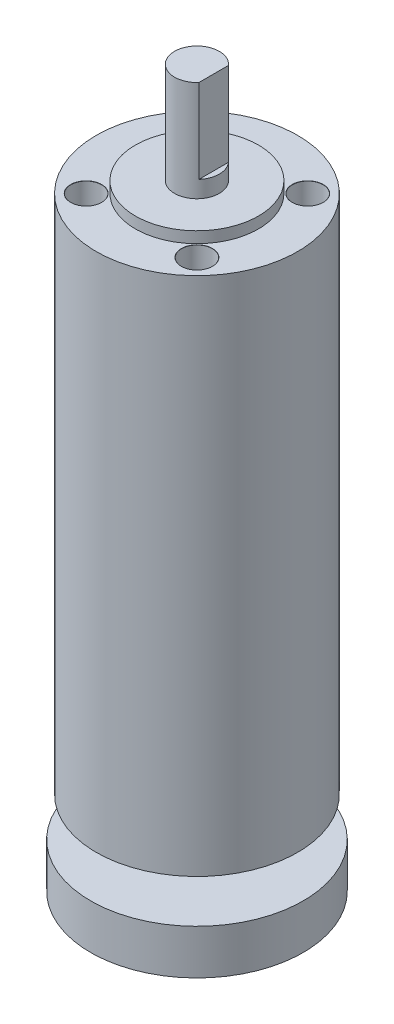
ISO-10303-21;
HEADER;
FILE_DESCRIPTION(('STEP AP214'),'2;1');
FILE_NAME('part.step','',(''),(''),'','','');
FILE_SCHEMA(('AUTOMOTIVE_DESIGN { 1 0 10303 214 1 1 1 1 }'));
ENDSEC;
DATA;
#1=APPLICATION_CONTEXT('core data for automotive mechanical design processes');
#2=APPLICATION_PROTOCOL_DEFINITION('international standard','automotive_design',2000,#1);
#3=PRODUCT_CONTEXT('',#1,'mechanical');
#4=PRODUCT('Part','Part','',(#3));
#5=PRODUCT_RELATED_PRODUCT_CATEGORY('part','',(#4));
#6=PRODUCT_DEFINITION_FORMATION('','',#4);
#7=PRODUCT_DEFINITION_CONTEXT('part definition',#1,'design');
#8=PRODUCT_DEFINITION('design','',#6,#7);
#9=PRODUCT_DEFINITION_SHAPE('','',#8);
#10=(LENGTH_UNIT() NAMED_UNIT(*) SI_UNIT(.MILLI.,.METRE.));
#11=(NAMED_UNIT(*) PLANE_ANGLE_UNIT() SI_UNIT($,.RADIAN.));
#12=(NAMED_UNIT(*) SI_UNIT($,.STERADIAN.) SOLID_ANGLE_UNIT());
#13=UNCERTAINTY_MEASURE_WITH_UNIT(LENGTH_MEASURE(1.E-05),#10,'distance_accuracy_value','');
#14=(GEOMETRIC_REPRESENTATION_CONTEXT(3) GLOBAL_UNCERTAINTY_ASSIGNED_CONTEXT((#13)) GLOBAL_UNIT_ASSIGNED_CONTEXT((#10,
#11,#12)) REPRESENTATION_CONTEXT('',''));
#15=CARTESIAN_POINT('',(0.,0.,0.));
#16=DIRECTION('',(0.,0.,1.));
#17=DIRECTION('',(1.,0.,0.));
#18=AXIS2_PLACEMENT_3D('',#15,#16,#17);
#19=CARTESIAN_POINT('',(0.,-15.,0.));
#20=DIRECTION('',(0.,1.,0.));
#21=DIRECTION('',(-1.,0.,0.));
#22=AXIS2_PLACEMENT_3D('',#19,#20,#21);
#23=PLANE('',#22);
#24=CARTESIAN_POINT('',(0.,-15.,0.));
#25=DIRECTION('',(0.,1.,0.));
#26=DIRECTION('',(-1.,0.,0.));
#27=AXIS2_PLACEMENT_3D('',#24,#25,#26);
#28=CIRCLE('',#27,19.);
#29=CARTESIAN_POINT('',(-19.,-15.,0.));
#30=VERTEX_POINT('',#29);
#31=EDGE_CURVE('E158',#30,#30,#28,.T.);
#32=ORIENTED_EDGE('',*,*,#31,.F.);
#33=EDGE_LOOP('',(#32));
#34=FACE_BOUND('',#33,.T.);
#35=ADVANCED_FACE('F45',(#34),#23,.F.);
#36=CARTESIAN_POINT('',(0.,113.,0.));
#37=DIRECTION('',(0.,1.,0.));
#38=DIRECTION('',(-1.,0.,0.));
#39=AXIS2_PLACEMENT_3D('',#36,#37,#38);
#40=CYLINDRICAL_SURFACE('',#39,19.);
#41=CARTESIAN_POINT('',(0.,-7.00000000000001,0.));
#42=DIRECTION('',(0.,1.,0.));
#43=DIRECTION('',(-1.,0.,0.));
#44=AXIS2_PLACEMENT_3D('',#41,#42,#43);
#45=CIRCLE('',#44,19.);
#46=CARTESIAN_POINT('',(-19.,-7.00000000000001,0.));
#47=VERTEX_POINT('',#46);
#48=EDGE_CURVE('E155',#47,#47,#45,.T.);
#49=ORIENTED_EDGE('',*,*,#48,.F.);
#50=EDGE_LOOP('',(#49));
#51=FACE_BOUND('',#50,.T.);
#52=ORIENTED_EDGE('',*,*,#31,.T.);
#53=EDGE_LOOP('',(#52));
#54=FACE_BOUND('',#53,.T.);
#55=ADVANCED_FACE('F180',(#51,#54),#40,.T.);
#56=CARTESIAN_POINT('',(19.,-7.,0.));
#57=DIRECTION('',(0.,-1.,0.));
#58=DIRECTION('',(1.,0.,0.));
#59=AXIS2_PLACEMENT_3D('',#56,#57,#58);
#60=PLANE('',#59);
#61=CARTESIAN_POINT('',(0.,-7.00000000000001,0.));
#62=DIRECTION('',(0.,1.,0.));
#63=DIRECTION('',(-1.,0.,0.));
#64=AXIS2_PLACEMENT_3D('',#61,#62,#63);
#65=CIRCLE('',#64,7.);
#66=CARTESIAN_POINT('',(-7.,-7.00000000000001,0.));
#67=VERTEX_POINT('',#66);
#68=EDGE_CURVE('E152',#67,#67,#65,.T.);
#69=ORIENTED_EDGE('',*,*,#68,.F.);
#70=EDGE_LOOP('',(#69));
#71=FACE_BOUND('',#70,.T.);
#72=ORIENTED_EDGE('',*,*,#48,.T.);
#73=EDGE_LOOP('',(#72));
#74=FACE_BOUND('',#73,.T.);
#75=ADVANCED_FACE('F185',(#71,#74),#60,.F.);
#76=CARTESIAN_POINT('',(0.,113.,0.));
#77=DIRECTION('',(0.,1.,0.));
#78=DIRECTION('',(-1.,0.,0.));
#79=AXIS2_PLACEMENT_3D('',#76,#77,#78);
#80=CYLINDRICAL_SURFACE('',#79,7.);
#81=CARTESIAN_POINT('',(0.,0.,0.));
#82=DIRECTION('',(0.,1.,0.));
#83=DIRECTION('',(-1.,0.,0.));
#84=AXIS2_PLACEMENT_3D('',#81,#82,#83);
#85=CIRCLE('',#84,7.);
#86=CARTESIAN_POINT('',(-7.,0.,0.));
#87=VERTEX_POINT('',#86);
#88=EDGE_CURVE('E149',#87,#87,#85,.T.);
#89=ORIENTED_EDGE('',*,*,#88,.F.);
#90=EDGE_LOOP('',(#89));
#91=FACE_BOUND('',#90,.T.);
#92=ORIENTED_EDGE('',*,*,#68,.T.);
#93=EDGE_LOOP('',(#92));
#94=FACE_BOUND('',#93,.T.);
#95=ADVANCED_FACE('F192',(#91,#94),#80,.T.);
#96=CARTESIAN_POINT('',(7.,0.,0.));
#97=DIRECTION('',(0.,1.,0.));
#98=DIRECTION('',(-1.,0.,0.));
#99=AXIS2_PLACEMENT_3D('',#96,#97,#98);
#100=PLANE('',#99);
#101=CARTESIAN_POINT('',(0.,0.,0.));
#102=DIRECTION('',(0.,1.,0.));
#103=DIRECTION('',(-1.,0.,0.));
#104=AXIS2_PLACEMENT_3D('',#101,#102,#103);
#105=CIRCLE('',#104,18.);
#106=CARTESIAN_POINT('',(-18.,0.,0.));
#107=VERTEX_POINT('',#106);
#108=EDGE_CURVE('E146',#107,#107,#105,.T.);
#109=ORIENTED_EDGE('',*,*,#108,.F.);
#110=EDGE_LOOP('',(#109));
#111=FACE_BOUND('',#110,.T.);
#112=ORIENTED_EDGE('',*,*,#88,.T.);
#113=EDGE_LOOP('',(#112));
#114=FACE_BOUND('',#113,.T.);
#115=ADVANCED_FACE('F199',(#111,#114),#100,.F.);
#116=CARTESIAN_POINT('',(0.,113.,0.));
#117=DIRECTION('',(0.,1.,0.));
#118=DIRECTION('',(-1.,0.,0.));
#119=AXIS2_PLACEMENT_3D('',#116,#117,#118);
#120=CYLINDRICAL_SURFACE('',#119,18.);
#121=CARTESIAN_POINT('',(0.,93.,0.));
#122=DIRECTION('',(0.,1.,0.));
#123=DIRECTION('',(-1.,0.,0.));
#124=AXIS2_PLACEMENT_3D('',#121,#122,#123);
#125=CIRCLE('',#124,18.);
#126=CARTESIAN_POINT('',(-18.,93.,0.));
#127=VERTEX_POINT('',#126);
#128=EDGE_CURVE('E143',#127,#127,#125,.T.);
#129=ORIENTED_EDGE('',*,*,#128,.F.);
#130=EDGE_LOOP('',(#129));
#131=FACE_BOUND('',#130,.T.);
#132=ORIENTED_EDGE('',*,*,#108,.T.);
#133=EDGE_LOOP('',(#132));
#134=FACE_BOUND('',#133,.T.);
#135=ADVANCED_FACE('F203',(#131,#134),#120,.T.);
#136=CARTESIAN_POINT('',(18.,93.,0.));
#137=DIRECTION('',(0.,-1.,0.));
#138=DIRECTION('',(1.,0.,0.));
#139=AXIS2_PLACEMENT_3D('',#136,#137,#138);
#140=PLANE('',#139);
#141=CARTESIAN_POINT('',(-9.89949493661168,93.,9.89949493661165));
#142=DIRECTION('',(0.,1.,0.));
#143=DIRECTION('',(0.,0.,1.));
#144=AXIS2_PLACEMENT_3D('',#141,#142,#143);
#145=CIRCLE('',#144,2.775);
#146=CARTESIAN_POINT('',(-9.89949493661168,93.,12.6744949366116));
#147=VERTEX_POINT('',#146);
#148=EDGE_CURVE('E98',#147,#147,#145,.T.);
#149=ORIENTED_EDGE('',*,*,#148,.F.);
#150=EDGE_LOOP('',(#149));
#151=FACE_BOUND('',#150,.T.);
#152=CARTESIAN_POINT('',(9.89949493661169,93.,9.89949493661165));
#153=DIRECTION('',(0.,1.,0.));
#154=DIRECTION('',(0.,0.,1.));
#155=AXIS2_PLACEMENT_3D('',#152,#153,#154);
#156=CIRCLE('',#155,2.775);
#157=CARTESIAN_POINT('',(9.89949493661169,93.,12.6744949366116));
#158=VERTEX_POINT('',#157);
#159=EDGE_CURVE('E91',#158,#158,#156,.T.);
#160=ORIENTED_EDGE('',*,*,#159,.F.);
#161=EDGE_LOOP('',(#160));
#162=FACE_BOUND('',#161,.T.);
#163=CARTESIAN_POINT('',(9.89949493661169,93.,-9.89949493661165));
#164=DIRECTION('',(0.,1.,0.));
#165=DIRECTION('',(0.,0.,1.));
#166=AXIS2_PLACEMENT_3D('',#163,#164,#165);
#167=CIRCLE('',#166,2.775);
#168=CARTESIAN_POINT('',(9.89949493661169,93.,-7.12449493661165));
#169=VERTEX_POINT('',#168);
#170=EDGE_CURVE('E107',#169,#169,#167,.T.);
#171=ORIENTED_EDGE('',*,*,#170,.F.);
#172=EDGE_LOOP('',(#171));
#173=FACE_BOUND('',#172,.T.);
#174=CARTESIAN_POINT('',(-9.89949493661168,93.,-9.89949493661165));
#175=DIRECTION('',(0.,1.,0.));
#176=DIRECTION('',(0.,0.,1.));
#177=AXIS2_PLACEMENT_3D('',#174,#175,#176);
#178=CIRCLE('',#177,2.775);
#179=CARTESIAN_POINT('',(-9.89949493661168,93.,-7.12449493661165));
#180=VERTEX_POINT('',#179);
#181=EDGE_CURVE('E116',#180,#180,#178,.T.);
#182=ORIENTED_EDGE('',*,*,#181,.F.);
#183=EDGE_LOOP('',(#182));
#184=FACE_BOUND('',#183,.T.);
#185=CARTESIAN_POINT('',(0.,93.,0.));
#186=DIRECTION('',(0.,1.,0.));
#187=DIRECTION('',(-1.,0.,0.));
#188=AXIS2_PLACEMENT_3D('',#185,#186,#187);
#189=CIRCLE('',#188,11.);
#190=CARTESIAN_POINT('',(-11.,93.,0.));
#191=VERTEX_POINT('',#190);
#192=EDGE_CURVE('E140',#191,#191,#189,.T.);
#193=ORIENTED_EDGE('',*,*,#192,.F.);
#194=EDGE_LOOP('',(#193));
#195=FACE_BOUND('',#194,.T.);
#196=ORIENTED_EDGE('',*,*,#128,.T.);
#197=EDGE_LOOP('',(#196));
#198=FACE_BOUND('',#197,.T.);
#199=ADVANCED_FACE('F207',(#151,#162,#173,#184,#195,#198),#140,.F.);
#200=CARTESIAN_POINT('',(0.,113.,0.));
#201=DIRECTION('',(0.,1.,0.));
#202=DIRECTION('',(-1.,0.,0.));
#203=AXIS2_PLACEMENT_3D('',#200,#201,#202);
#204=CYLINDRICAL_SURFACE('',#203,11.);
#205=CARTESIAN_POINT('',(0.,95.,0.));
#206=DIRECTION('',(0.,1.,0.));
#207=DIRECTION('',(-1.,0.,0.));
#208=AXIS2_PLACEMENT_3D('',#205,#206,#207);
#209=CIRCLE('',#208,11.);
#210=CARTESIAN_POINT('',(-11.,95.,0.));
#211=VERTEX_POINT('',#210);
#212=EDGE_CURVE('E137',#211,#211,#209,.T.);
#213=ORIENTED_EDGE('',*,*,#212,.F.);
#214=EDGE_LOOP('',(#213));
#215=FACE_BOUND('',#214,.T.);
#216=ORIENTED_EDGE('',*,*,#192,.T.);
#217=EDGE_LOOP('',(#216));
#218=FACE_BOUND('',#217,.T.);
#219=ADVANCED_FACE('F211',(#215,#218),#204,.T.);
#220=CARTESIAN_POINT('',(11.,95.,0.));
#221=DIRECTION('',(0.,-1.,0.));
#222=DIRECTION('',(1.,0.,0.));
#223=AXIS2_PLACEMENT_3D('',#220,#221,#222);
#224=PLANE('',#223);
#225=CARTESIAN_POINT('',(0.,95.,0.));
#226=DIRECTION('',(0.,1.,0.));
#227=DIRECTION('',(-1.,0.,0.));
#228=AXIS2_PLACEMENT_3D('',#225,#226,#227);
#229=CIRCLE('',#228,4.);
#230=CARTESIAN_POINT('',(-3.99999999999999,95.,0.));
#231=VERTEX_POINT('',#230);
#232=EDGE_CURVE('E134',#231,#231,#229,.T.);
#233=ORIENTED_EDGE('',*,*,#232,.F.);
#234=EDGE_LOOP('',(#233));
#235=FACE_BOUND('',#234,.T.);
#236=ORIENTED_EDGE('',*,*,#212,.T.);
#237=EDGE_LOOP('',(#236));
#238=FACE_BOUND('',#237,.T.);
#239=ADVANCED_FACE('F215',(#235,#238),#224,.F.);
#240=CARTESIAN_POINT('',(0.,113.,0.));
#241=DIRECTION('',(0.,1.,0.));
#242=DIRECTION('',(-1.,0.,0.));
#243=AXIS2_PLACEMENT_3D('',#240,#241,#242);
#244=CYLINDRICAL_SURFACE('',#243,3.99999999999999);
#245=CARTESIAN_POINT('',(0.,98.,0.));
#246=DIRECTION('',(0.,-1.,0.));
#247=DIRECTION('',(0.,0.,-1.));
#248=AXIS2_PLACEMENT_3D('',#245,#246,#247);
#249=CIRCLE('',#248,3.99999999999999);
#250=CARTESIAN_POINT('',(3.00000000000001,98.,-2.64575131106458));
#251=VERTEX_POINT('',#250);
#252=CARTESIAN_POINT('',(3.00000000000001,98.,2.64575131106458));
#253=VERTEX_POINT('',#252);
#254=EDGE_CURVE('E11',#251,#253,#249,.T.);
#255=ORIENTED_EDGE('',*,*,#254,.T.);
#256=DIRECTION('',(0.,1.,0.));
#257=VECTOR('',#256,1.);
#258=CARTESIAN_POINT('',(3.00000000000001,113.,2.64575131106458));
#259=LINE('',#258,#257);
#260=CARTESIAN_POINT('',(3.00000000000001,113.,2.64575131106458));
#261=VERTEX_POINT('',#260);
#262=EDGE_CURVE('E129',#253,#261,#259,.T.);
#263=ORIENTED_EDGE('',*,*,#262,.T.);
#264=CARTESIAN_POINT('',(0.,113.,0.));
#265=DIRECTION('',(0.,1.,0.));
#266=DIRECTION('',(-1.,0.,0.));
#267=AXIS2_PLACEMENT_3D('',#264,#265,#266);
#268=CIRCLE('',#267,3.99999999999999);
#269=CARTESIAN_POINT('',(3.00000000000001,113.,-2.64575131106458));
#270=VERTEX_POINT('',#269);
#271=EDGE_CURVE('E131',#270,#261,#268,.T.);
#272=ORIENTED_EDGE('',*,*,#271,.F.);
#273=DIRECTION('',(0.,1.,0.));
#274=VECTOR('',#273,1.);
#275=CARTESIAN_POINT('',(3.00000000000001,113.,-2.64575131106458));
#276=LINE('',#275,#274);
#277=EDGE_CURVE('E59',#270,#251,#276,.F.);
#278=ORIENTED_EDGE('',*,*,#277,.T.);
#279=EDGE_LOOP('',(#255,#263,#272,#278));
#280=FACE_BOUND('',#279,.T.);
#281=ORIENTED_EDGE('',*,*,#232,.T.);
#282=EDGE_LOOP('',(#281));
#283=FACE_BOUND('',#282,.T.);
#284=ADVANCED_FACE('F164',(#280,#283),#244,.T.);
#285=CARTESIAN_POINT('',(4.,113.,0.));
#286=DIRECTION('',(0.,-1.,0.));
#287=DIRECTION('',(1.,0.,0.));
#288=AXIS2_PLACEMENT_3D('',#285,#286,#287);
#289=PLANE('',#288);
#290=ORIENTED_EDGE('',*,*,#271,.T.);
#291=DIRECTION('',(0.,0.,-1.));
#292=VECTOR('',#291,1.);
#293=CARTESIAN_POINT('',(3.00000000000001,113.,0.));
#294=LINE('',#293,#292);
#295=EDGE_CURVE('E52',#261,#270,#294,.T.);
#296=ORIENTED_EDGE('',*,*,#295,.T.);
#297=EDGE_LOOP('',(#290,#296));
#298=FACE_BOUND('',#297,.T.);
#299=ADVANCED_FACE('F162',(#298),#289,.F.);
#300=CARTESIAN_POINT('',(0.,98.,-19.));
#301=DIRECTION('',(0.,-1.,0.));
#302=DIRECTION('',(0.,0.,-1.));
#303=AXIS2_PLACEMENT_3D('',#300,#301,#302);
#304=PLANE('',#303);
#305=DIRECTION('',(0.,0.,1.));
#306=VECTOR('',#305,1.);
#307=CARTESIAN_POINT('',(3.00000000000001,98.,-19.));
#308=LINE('',#307,#306);
#309=EDGE_CURVE('E125',#251,#253,#308,.T.);
#310=ORIENTED_EDGE('',*,*,#309,.T.);
#311=ORIENTED_EDGE('',*,*,#254,.F.);
#312=EDGE_LOOP('',(#310,#311));
#313=FACE_BOUND('',#312,.T.);
#314=ADVANCED_FACE('F168',(#313),#304,.F.);
#315=CARTESIAN_POINT('',(3.00000000000001,0.,-19.));
#316=DIRECTION('',(-1.,0.,0.));
#317=DIRECTION('',(0.,0.,1.));
#318=AXIS2_PLACEMENT_3D('',#315,#316,#317);
#319=PLANE('',#318);
#320=ORIENTED_EDGE('',*,*,#309,.F.);
#321=ORIENTED_EDGE('',*,*,#277,.F.);
#322=ORIENTED_EDGE('',*,*,#295,.F.);
#323=ORIENTED_EDGE('',*,*,#262,.F.);
#324=EDGE_LOOP('',(#320,#321,#322,#323));
#325=FACE_BOUND('',#324,.T.);
#326=ADVANCED_FACE('F166',(#325),#319,.F.);
#327=CARTESIAN_POINT('',(-9.89949493661168,80.,-9.89949493661165));
#328=DIRECTION('',(0.,1.,0.));
#329=DIRECTION('',(0.,0.,1.));
#330=AXIS2_PLACEMENT_3D('',#327,#328,#329);
#331=CONICAL_SURFACE('',#330,2.74999999999999,1.02974425867665);
#332=CARTESIAN_POINT('',(-9.89949493661168,78.3476332976742,-9.89949493661165));
#333=VERTEX_POINT('',#332);
#334=VERTEX_LOOP('',#333);
#335=FACE_BOUND('',#334,.T.);
#336=CARTESIAN_POINT('',(-9.89949493661168,80.,-9.89949493661165));
#337=DIRECTION('',(0.,1.,0.));
#338=DIRECTION('',(0.,0.,1.));
#339=AXIS2_PLACEMENT_3D('',#336,#337,#338);
#340=CIRCLE('',#339,2.74999999999999);
#341=CARTESIAN_POINT('',(-9.89949493661168,80.,-7.14949493661166));
#342=VERTEX_POINT('',#341);
#343=EDGE_CURVE('E122',#342,#342,#340,.T.);
#344=ORIENTED_EDGE('',*,*,#343,.T.);
#345=EDGE_LOOP('',(#344));
#346=FACE_BOUND('',#345,.T.);
#347=ADVANCED_FACE('F175',(#335,#346),#331,.F.);
#348=CARTESIAN_POINT('',(-9.89949493661168,93.,-9.89949493661165));
#349=DIRECTION('',(0.,1.,0.));
#350=DIRECTION('',(0.,0.,1.));
#351=AXIS2_PLACEMENT_3D('',#348,#349,#350);
#352=CYLINDRICAL_SURFACE('',#351,2.74999999999999);
#353=ORIENTED_EDGE('',*,*,#343,.F.);
#354=EDGE_LOOP('',(#353));
#355=FACE_BOUND('',#354,.T.);
#356=CARTESIAN_POINT('',(-9.89949493661168,92.975,-9.89949493661165));
#357=DIRECTION('',(0.,1.,0.));
#358=DIRECTION('',(0.,0.,1.));
#359=AXIS2_PLACEMENT_3D('',#356,#357,#358);
#360=CIRCLE('',#359,2.75);
#361=CARTESIAN_POINT('',(-9.89949493661168,92.975,-7.14949493661165));
#362=VERTEX_POINT('',#361);
#363=EDGE_CURVE('E119',#362,#362,#360,.T.);
#364=ORIENTED_EDGE('',*,*,#363,.T.);
#365=EDGE_LOOP('',(#364));
#366=FACE_BOUND('',#365,.T.);
#367=ADVANCED_FACE('F250',(#355,#366),#352,.F.);
#368=CARTESIAN_POINT('',(-9.89949493661168,93.,-9.89949493661165));
#369=DIRECTION('',(0.,1.,0.));
#370=DIRECTION('',(0.,0.,1.));
#371=AXIS2_PLACEMENT_3D('',#368,#369,#370);
#372=CONICAL_SURFACE('',#371,2.775,0.785398163397518);
#373=ORIENTED_EDGE('',*,*,#363,.F.);
#374=EDGE_LOOP('',(#373));
#375=FACE_BOUND('',#374,.T.);
#376=ORIENTED_EDGE('',*,*,#181,.T.);
#377=EDGE_LOOP('',(#376));
#378=FACE_BOUND('',#377,.T.);
#379=ADVANCED_FACE('F259',(#375,#378),#372,.F.);
#380=CARTESIAN_POINT('',(9.89949493661169,80.,-9.89949493661165));
#381=DIRECTION('',(0.,1.,0.));
#382=DIRECTION('',(0.,0.,1.));
#383=AXIS2_PLACEMENT_3D('',#380,#381,#382);
#384=CONICAL_SURFACE('',#383,2.74999999999999,1.02974425867665);
#385=CARTESIAN_POINT('',(9.89949493661168,78.3476332976742,-9.89949493661165));
#386=VERTEX_POINT('',#385);
#387=VERTEX_LOOP('',#386);
#388=FACE_BOUND('',#387,.T.);
#389=CARTESIAN_POINT('',(9.89949493661169,80.,-9.89949493661165));
#390=DIRECTION('',(0.,1.,0.));
#391=DIRECTION('',(0.,0.,1.));
#392=AXIS2_PLACEMENT_3D('',#389,#390,#391);
#393=CIRCLE('',#392,2.74999999999999);
#394=CARTESIAN_POINT('',(9.89949493661169,80.,-7.14949493661166));
#395=VERTEX_POINT('',#394);
#396=EDGE_CURVE('E113',#395,#395,#393,.T.);
#397=ORIENTED_EDGE('',*,*,#396,.T.);
#398=EDGE_LOOP('',(#397));
#399=FACE_BOUND('',#398,.T.);
#400=ADVANCED_FACE('F269',(#388,#399),#384,.F.);
#401=CARTESIAN_POINT('',(9.89949493661169,93.,-9.89949493661165));
#402=DIRECTION('',(0.,1.,0.));
#403=DIRECTION('',(0.,0.,1.));
#404=AXIS2_PLACEMENT_3D('',#401,#402,#403);
#405=CYLINDRICAL_SURFACE('',#404,2.74999999999999);
#406=ORIENTED_EDGE('',*,*,#396,.F.);
#407=EDGE_LOOP('',(#406));
#408=FACE_BOUND('',#407,.T.);
#409=CARTESIAN_POINT('',(9.89949493661169,92.975,-9.89949493661165));
#410=DIRECTION('',(0.,1.,0.));
#411=DIRECTION('',(0.,0.,1.));
#412=AXIS2_PLACEMENT_3D('',#409,#410,#411);
#413=CIRCLE('',#412,2.75);
#414=CARTESIAN_POINT('',(9.89949493661169,92.975,-7.14949493661165));
#415=VERTEX_POINT('',#414);
#416=EDGE_CURVE('E110',#415,#415,#413,.T.);
#417=ORIENTED_EDGE('',*,*,#416,.T.);
#418=EDGE_LOOP('',(#417));
#419=FACE_BOUND('',#418,.T.);
#420=ADVANCED_FACE('F279',(#408,#419),#405,.F.);
#421=CARTESIAN_POINT('',(9.89949493661169,93.,-9.89949493661165));
#422=DIRECTION('',(0.,1.,0.));
#423=DIRECTION('',(0.,0.,1.));
#424=AXIS2_PLACEMENT_3D('',#421,#422,#423);
#425=CONICAL_SURFACE('',#424,2.775,0.785398163397518);
#426=ORIENTED_EDGE('',*,*,#416,.F.);
#427=EDGE_LOOP('',(#426));
#428=FACE_BOUND('',#427,.T.);
#429=ORIENTED_EDGE('',*,*,#170,.T.);
#430=EDGE_LOOP('',(#429));
#431=FACE_BOUND('',#430,.T.);
#432=ADVANCED_FACE('F289',(#428,#431),#425,.F.);
#433=CARTESIAN_POINT('',(9.89949493661169,80.,9.89949493661165));
#434=DIRECTION('',(0.,1.,0.));
#435=DIRECTION('',(0.,0.,1.));
#436=AXIS2_PLACEMENT_3D('',#433,#434,#435);
#437=CONICAL_SURFACE('',#436,2.74999999999999,1.02974425867665);
#438=CARTESIAN_POINT('',(9.89949493661168,78.3476332976742,9.89949493661165));
#439=VERTEX_POINT('',#438);
#440=VERTEX_LOOP('',#439);
#441=FACE_BOUND('',#440,.T.);
#442=CARTESIAN_POINT('',(9.89949493661169,80.,9.89949493661165));
#443=DIRECTION('',(0.,1.,0.));
#444=DIRECTION('',(0.,0.,1.));
#445=AXIS2_PLACEMENT_3D('',#442,#443,#444);
#446=CIRCLE('',#445,2.74999999999999);
#447=CARTESIAN_POINT('',(9.89949493661169,80.,12.6494949366116));
#448=VERTEX_POINT('',#447);
#449=EDGE_CURVE('E104',#448,#448,#446,.T.);
#450=ORIENTED_EDGE('',*,*,#449,.T.);
#451=EDGE_LOOP('',(#450));
#452=FACE_BOUND('',#451,.T.);
#453=ADVANCED_FACE('F299',(#441,#452),#437,.F.);
#454=CARTESIAN_POINT('',(9.89949493661169,93.,9.89949493661165));
#455=DIRECTION('',(0.,1.,0.));
#456=DIRECTION('',(0.,0.,1.));
#457=AXIS2_PLACEMENT_3D('',#454,#455,#456);
#458=CYLINDRICAL_SURFACE('',#457,2.74999999999999);
#459=ORIENTED_EDGE('',*,*,#449,.F.);
#460=EDGE_LOOP('',(#459));
#461=FACE_BOUND('',#460,.T.);
#462=CARTESIAN_POINT('',(9.89949493661169,92.975,9.89949493661165));
#463=DIRECTION('',(0.,1.,0.));
#464=DIRECTION('',(0.,0.,1.));
#465=AXIS2_PLACEMENT_3D('',#462,#463,#464);
#466=CIRCLE('',#465,2.75);
#467=CARTESIAN_POINT('',(9.89949493661169,92.975,12.6494949366116));
#468=VERTEX_POINT('',#467);
#469=EDGE_CURVE('E95',#468,#468,#466,.T.);
#470=ORIENTED_EDGE('',*,*,#469,.T.);
#471=EDGE_LOOP('',(#470));
#472=FACE_BOUND('',#471,.T.);
#473=ADVANCED_FACE('F309',(#461,#472),#458,.F.);
#474=CARTESIAN_POINT('',(9.89949493661169,93.,9.89949493661165));
#475=DIRECTION('',(0.,1.,0.));
#476=DIRECTION('',(0.,0.,1.));
#477=AXIS2_PLACEMENT_3D('',#474,#475,#476);
#478=CONICAL_SURFACE('',#477,2.775,0.785398163397518);
#479=ORIENTED_EDGE('',*,*,#469,.F.);
#480=EDGE_LOOP('',(#479));
#481=FACE_BOUND('',#480,.T.);
#482=ORIENTED_EDGE('',*,*,#159,.T.);
#483=EDGE_LOOP('',(#482));
#484=FACE_BOUND('',#483,.T.);
#485=ADVANCED_FACE('F85',(#481,#484),#478,.F.);
#486=CARTESIAN_POINT('',(-9.89949493661168,80.,9.89949493661165));
#487=DIRECTION('',(0.,1.,0.));
#488=DIRECTION('',(0.,0.,1.));
#489=AXIS2_PLACEMENT_3D('',#486,#487,#488);
#490=CONICAL_SURFACE('',#489,2.74999999999999,1.02974425867665);
#491=CARTESIAN_POINT('',(-9.89949493661168,78.3476332976742,9.89949493661165));
#492=VERTEX_POINT('',#491);
#493=VERTEX_LOOP('',#492);
#494=FACE_BOUND('',#493,.T.);
#495=CARTESIAN_POINT('',(-9.89949493661168,80.,9.89949493661165));
#496=DIRECTION('',(0.,1.,0.));
#497=DIRECTION('',(0.,0.,1.));
#498=AXIS2_PLACEMENT_3D('',#495,#496,#497);
#499=CIRCLE('',#498,2.74999999999999);
#500=CARTESIAN_POINT('',(-9.89949493661168,80.,12.6494949366116));
#501=VERTEX_POINT('',#500);
#502=EDGE_CURVE('E89',#501,#501,#499,.T.);
#503=ORIENTED_EDGE('',*,*,#502,.T.);
#504=EDGE_LOOP('',(#503));
#505=FACE_BOUND('',#504,.T.);
#506=ADVANCED_FACE('F81',(#494,#505),#490,.F.);
#507=CARTESIAN_POINT('',(-9.89949493661168,93.,9.89949493661165));
#508=DIRECTION('',(0.,1.,0.));
#509=DIRECTION('',(0.,0.,1.));
#510=AXIS2_PLACEMENT_3D('',#507,#508,#509);
#511=CYLINDRICAL_SURFACE('',#510,2.74999999999999);
#512=ORIENTED_EDGE('',*,*,#502,.F.);
#513=EDGE_LOOP('',(#512));
#514=FACE_BOUND('',#513,.T.);
#515=CARTESIAN_POINT('',(-9.89949493661168,92.975,9.89949493661165));
#516=DIRECTION('',(0.,1.,0.));
#517=DIRECTION('',(0.,0.,1.));
#518=AXIS2_PLACEMENT_3D('',#515,#516,#517);
#519=CIRCLE('',#518,2.75);
#520=CARTESIAN_POINT('',(-9.89949493661168,92.975,12.6494949366116));
#521=VERTEX_POINT('',#520);
#522=EDGE_CURVE('E92',#521,#521,#519,.T.);
#523=ORIENTED_EDGE('',*,*,#522,.T.);
#524=EDGE_LOOP('',(#523));
#525=FACE_BOUND('',#524,.T.);
#526=ADVANCED_FACE('F84',(#514,#525),#511,.F.);
#527=CARTESIAN_POINT('',(-9.89949493661168,93.,9.89949493661165));
#528=DIRECTION('',(0.,1.,0.));
#529=DIRECTION('',(0.,0.,1.));
#530=AXIS2_PLACEMENT_3D('',#527,#528,#529);
#531=CONICAL_SURFACE('',#530,2.775,0.785398163397518);
#532=ORIENTED_EDGE('',*,*,#522,.F.);
#533=EDGE_LOOP('',(#532));
#534=FACE_BOUND('',#533,.T.);
#535=ORIENTED_EDGE('',*,*,#148,.T.);
#536=EDGE_LOOP('',(#535));
#537=FACE_BOUND('',#536,.T.);
#538=ADVANCED_FACE('F343',(#534,#537),#531,.F.);
#539=CLOSED_SHELL('',(#35,#55,#75,#95,#115,#135,#199,#219,#239,#284,#299,#314,#326,#347,#367,
#379,#400,#420,#432,#453,#473,#485,#506,#526,#538));
#540=MANIFOLD_SOLID_BREP('B2',#539);
#541=ADVANCED_BREP_SHAPE_REPRESENTATION('',(#18,#540),#14);
#542=SHAPE_DEFINITION_REPRESENTATION(#9,#541);
ENDSEC;
END-ISO-10303-21;
